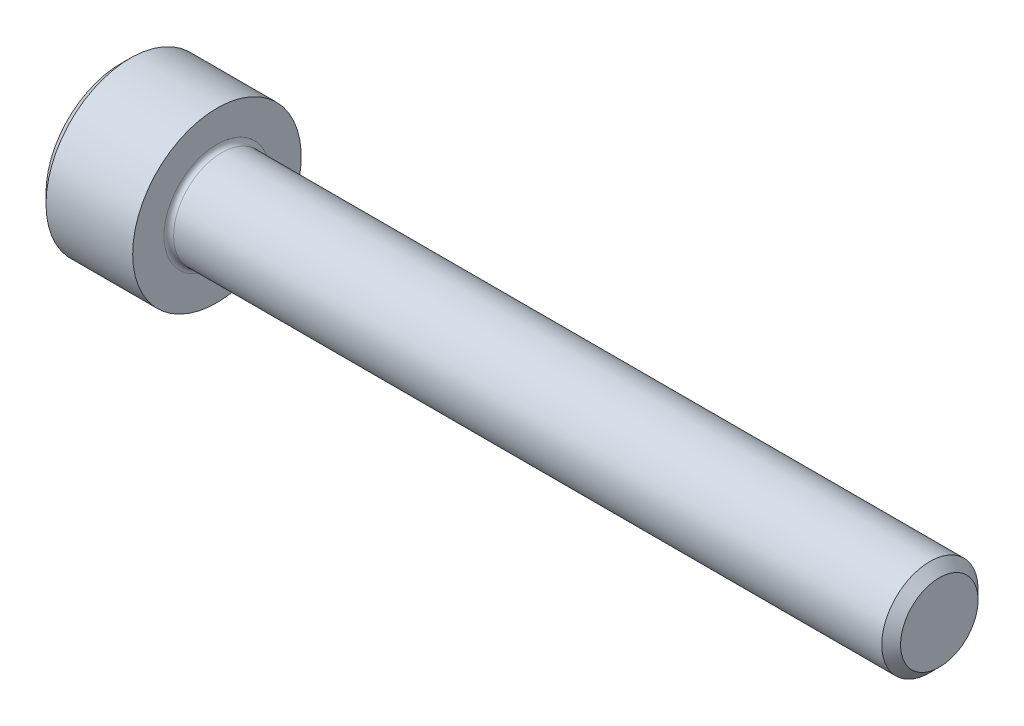
ISO-10303-21;
HEADER;
FILE_DESCRIPTION(('STEP AP214'),'2;1');
FILE_NAME('part.step','',(''),(''),'','','');
FILE_SCHEMA(('AUTOMOTIVE_DESIGN { 1 0 10303 214 1 1 1 1 }'));
ENDSEC;
DATA;
#1=APPLICATION_CONTEXT('core data for automotive mechanical design processes');
#2=APPLICATION_PROTOCOL_DEFINITION('international standard','automotive_design',2000,#1);
#3=PRODUCT_CONTEXT('',#1,'mechanical');
#4=PRODUCT('Part','Part','',(#3));
#5=PRODUCT_RELATED_PRODUCT_CATEGORY('part','',(#4));
#6=PRODUCT_DEFINITION_FORMATION('','',#4);
#7=PRODUCT_DEFINITION_CONTEXT('part definition',#1,'design');
#8=PRODUCT_DEFINITION('design','',#6,#7);
#9=PRODUCT_DEFINITION_SHAPE('','',#8);
#10=(LENGTH_UNIT() NAMED_UNIT(*) SI_UNIT(.MILLI.,.METRE.));
#11=(NAMED_UNIT(*) PLANE_ANGLE_UNIT() SI_UNIT($,.RADIAN.));
#12=(NAMED_UNIT(*) SI_UNIT($,.STERADIAN.) SOLID_ANGLE_UNIT());
#13=UNCERTAINTY_MEASURE_WITH_UNIT(LENGTH_MEASURE(1.E-05),#10,'distance_accuracy_value','');
#14=(GEOMETRIC_REPRESENTATION_CONTEXT(3) GLOBAL_UNCERTAINTY_ASSIGNED_CONTEXT((#13)) GLOBAL_UNIT_ASSIGNED_CONTEXT((#10,
#11,#12)) REPRESENTATION_CONTEXT('',''));
#15=CARTESIAN_POINT('',(0.,0.,0.));
#16=DIRECTION('',(0.,0.,1.));
#17=DIRECTION('',(1.,0.,0.));
#18=AXIS2_PLACEMENT_3D('',#15,#16,#17);
#19=CARTESIAN_POINT('',(0.,0.,0.));
#20=DIRECTION('',(-1.,0.,0.));
#21=DIRECTION('',(0.,0.,1.));
#22=AXIS2_PLACEMENT_3D('',#19,#20,#21);
#23=PLANE('',#22);
#24=DIRECTION('',(0.,-0.5,0.866025403784438));
#25=VECTOR('',#24,1.);
#26=CARTESIAN_POINT('',(0.,1.77304267668134,0.));
#27=LINE('',#26,#25);
#28=CARTESIAN_POINT('',(0.,1.77304267668134,0.));
#29=VERTEX_POINT('',#28);
#30=CARTESIAN_POINT('',(0.,0.886521338340669,1.5355));
#31=VERTEX_POINT('',#30);
#32=EDGE_CURVE('E387',#29,#31,#27,.T.);
#33=ORIENTED_EDGE('',*,*,#32,.T.);
#34=DIRECTION('',(0.,1.,0.));
#35=VECTOR('',#34,1.);
#36=CARTESIAN_POINT('',(0.,-0.886521338340673,1.5355));
#37=LINE('',#36,#35);
#38=CARTESIAN_POINT('',(0.,-0.886521338340673,1.5355));
#39=VERTEX_POINT('',#38);
#40=EDGE_CURVE('E131',#39,#31,#37,.T.);
#41=ORIENTED_EDGE('',*,*,#40,.F.);
#42=DIRECTION('',(0.,-0.500000000000001,-0.866025403784438));
#43=VECTOR('',#42,1.);
#44=CARTESIAN_POINT('',(0.,-0.886521338340673,1.5355));
#45=LINE('',#44,#43);
#46=CARTESIAN_POINT('',(0.,-1.77304267668135,0.));
#47=VERTEX_POINT('',#46);
#48=EDGE_CURVE('E390',#39,#47,#45,.T.);
#49=ORIENTED_EDGE('',*,*,#48,.T.);
#50=DIRECTION('',(0.,0.5,-0.866025403784439));
#51=VECTOR('',#50,1.);
#52=CARTESIAN_POINT('',(0.,-1.77304267668135,0.));
#53=LINE('',#52,#51);
#54=CARTESIAN_POINT('',(0.,-0.886521338340675,-1.5355));
#55=VERTEX_POINT('',#54);
#56=EDGE_CURVE('E393',#47,#55,#53,.T.);
#57=ORIENTED_EDGE('',*,*,#56,.T.);
#58=DIRECTION('',(0.,-1.,0.));
#59=VECTOR('',#58,1.);
#60=CARTESIAN_POINT('',(0.,0.886521338340666,-1.5355));
#61=LINE('',#60,#59);
#62=CARTESIAN_POINT('',(0.,0.886521338340666,-1.5355));
#63=VERTEX_POINT('',#62);
#64=EDGE_CURVE('E396',#63,#55,#61,.T.);
#65=ORIENTED_EDGE('',*,*,#64,.F.);
#66=DIRECTION('',(0.,-0.500000000000001,-0.866025403784438));
#67=VECTOR('',#66,1.);
#68=CARTESIAN_POINT('',(0.,1.77304267668134,0.));
#69=LINE('',#68,#67);
#70=EDGE_CURVE('E126',#29,#63,#69,.T.);
#71=ORIENTED_EDGE('',*,*,#70,.F.);
#72=EDGE_LOOP('',(#33,#41,#49,#57,#65,#71));
#73=FACE_BOUND('',#72,.T.);
#74=CARTESIAN_POINT('',(0.,0.,0.));
#75=DIRECTION('',(-1.,0.,0.));
#76=DIRECTION('',(0.,0.,1.));
#77=AXIS2_PLACEMENT_3D('',#74,#75,#76);
#78=CIRCLE('',#77,3.1);
#79=CARTESIAN_POINT('',(0.,0.,3.1));
#80=VERTEX_POINT('',#79);
#81=EDGE_CURVE('E142',#80,#80,#78,.T.);
#82=ORIENTED_EDGE('',*,*,#81,.T.);
#83=EDGE_LOOP('',(#82));
#84=FACE_BOUND('',#83,.T.);
#85=ADVANCED_FACE('F35',(#73,#84),#23,.T.);
#86=CARTESIAN_POINT('',(34.,1.61,0.));
#87=DIRECTION('',(1.,0.,0.));
#88=DIRECTION('',(0.,0.,-1.));
#89=AXIS2_PLACEMENT_3D('',#86,#87,#88);
#90=PLANE('',#89);
#91=CARTESIAN_POINT('',(34.,0.,0.));
#92=DIRECTION('',(-1.,0.,0.));
#93=DIRECTION('',(0.,0.,1.));
#94=AXIS2_PLACEMENT_3D('',#91,#92,#93);
#95=CIRCLE('',#94,1.61);
#96=CARTESIAN_POINT('',(34.,0.,1.61));
#97=VERTEX_POINT('',#96);
#98=EDGE_CURVE('E155',#97,#97,#95,.T.);
#99=ORIENTED_EDGE('',*,*,#98,.F.);
#100=EDGE_LOOP('',(#99));
#101=FACE_BOUND('',#100,.T.);
#102=ADVANCED_FACE('F176',(#101),#90,.T.);
#103=CARTESIAN_POINT('',(34.,0.,0.));
#104=DIRECTION('',(-1.,0.,0.));
#105=DIRECTION('',(0.,0.,1.));
#106=AXIS2_PLACEMENT_3D('',#103,#104,#105);
#107=CONICAL_SURFACE('',#106,1.61,0.78539816339732);
#108=CARTESIAN_POINT('',(33.61,0.,0.));
#109=DIRECTION('',(-1.,0.,0.));
#110=DIRECTION('',(0.,0.,1.));
#111=AXIS2_PLACEMENT_3D('',#108,#109,#110);
#112=CIRCLE('',#111,1.99999999999994);
#113=CARTESIAN_POINT('',(33.61,0.,1.99999999999994));
#114=VERTEX_POINT('',#113);
#115=EDGE_CURVE('E152',#114,#114,#112,.T.);
#116=ORIENTED_EDGE('',*,*,#115,.F.);
#117=EDGE_LOOP('',(#116));
#118=FACE_BOUND('',#117,.T.);
#119=ORIENTED_EDGE('',*,*,#98,.T.);
#120=EDGE_LOOP('',(#119));
#121=FACE_BOUND('',#120,.T.);
#122=ADVANCED_FACE('F182',(#118,#121),#107,.T.);
#123=CARTESIAN_POINT('',(-31.75,0.,0.));
#124=DIRECTION('',(-1.,0.,0.));
#125=DIRECTION('',(0.,0.,1.));
#126=AXIS2_PLACEMENT_3D('',#123,#124,#125);
#127=CYLINDRICAL_SURFACE('',#126,1.99999999999997);
#128=CARTESIAN_POINT('',(4.2,0.,0.));
#129=DIRECTION('',(1.,0.,0.));
#130=DIRECTION('',(0.,0.,-1.));
#131=AXIS2_PLACEMENT_3D('',#128,#129,#130);
#132=CIRCLE('',#131,1.99999999999997);
#133=CARTESIAN_POINT('',(4.2,0.,-1.99999999999997));
#134=VERTEX_POINT('',#133);
#135=EDGE_CURVE('E11',#134,#134,#132,.T.);
#136=ORIENTED_EDGE('',*,*,#135,.T.);
#137=EDGE_LOOP('',(#136));
#138=FACE_BOUND('',#137,.T.);
#139=ORIENTED_EDGE('',*,*,#115,.T.);
#140=EDGE_LOOP('',(#139));
#141=FACE_BOUND('',#140,.T.);
#142=ADVANCED_FACE('F193',(#138,#141),#127,.T.);
#143=CARTESIAN_POINT('',(4.,3.5,0.));
#144=DIRECTION('',(1.,0.,0.));
#145=DIRECTION('',(0.,0.,-1.));
#146=AXIS2_PLACEMENT_3D('',#143,#144,#145);
#147=PLANE('',#146);
#148=CARTESIAN_POINT('',(4.,0.,0.));
#149=DIRECTION('',(1.,0.,0.));
#150=DIRECTION('',(0.,0.,-1.));
#151=AXIS2_PLACEMENT_3D('',#148,#149,#150);
#152=CIRCLE('',#151,2.19999999999997);
#153=CARTESIAN_POINT('',(4.,0.,-2.19999999999997));
#154=VERTEX_POINT('',#153);
#155=EDGE_CURVE('E43',#154,#154,#152,.F.);
#156=ORIENTED_EDGE('',*,*,#155,.T.);
#157=EDGE_LOOP('',(#156));
#158=FACE_BOUND('',#157,.T.);
#159=CARTESIAN_POINT('',(4.,0.,0.));
#160=DIRECTION('',(-1.,0.,0.));
#161=DIRECTION('',(0.,0.,1.));
#162=AXIS2_PLACEMENT_3D('',#159,#160,#161);
#163=CIRCLE('',#162,3.5);
#164=CARTESIAN_POINT('',(4.,0.,3.5));
#165=VERTEX_POINT('',#164);
#166=EDGE_CURVE('E149',#165,#165,#163,.T.);
#167=ORIENTED_EDGE('',*,*,#166,.F.);
#168=EDGE_LOOP('',(#167));
#169=FACE_BOUND('',#168,.T.);
#170=ADVANCED_FACE('F160',(#158,#169),#147,.T.);
#171=CARTESIAN_POINT('',(-31.75,0.,0.));
#172=DIRECTION('',(-1.,0.,0.));
#173=DIRECTION('',(0.,0.,1.));
#174=AXIS2_PLACEMENT_3D('',#171,#172,#173);
#175=CYLINDRICAL_SURFACE('',#174,3.5);
#176=ORIENTED_EDGE('',*,*,#166,.T.);
#177=EDGE_LOOP('',(#176));
#178=FACE_BOUND('',#177,.T.);
#179=CARTESIAN_POINT('',(0.399999999999998,0.,0.));
#180=DIRECTION('',(-1.,0.,0.));
#181=DIRECTION('',(0.,0.,1.));
#182=AXIS2_PLACEMENT_3D('',#179,#180,#181);
#183=CIRCLE('',#182,3.5);
#184=CARTESIAN_POINT('',(0.399999999999998,0.,3.5));
#185=VERTEX_POINT('',#184);
#186=EDGE_CURVE('E146',#185,#185,#183,.T.);
#187=ORIENTED_EDGE('',*,*,#186,.F.);
#188=EDGE_LOOP('',(#187));
#189=FACE_BOUND('',#188,.T.);
#190=ADVANCED_FACE('F171',(#178,#189),#175,.T.);
#191=CARTESIAN_POINT('',(0.,0.,0.));
#192=DIRECTION('',(1.,0.,0.));
#193=DIRECTION('',(0.,0.,-1.));
#194=AXIS2_PLACEMENT_3D('',#191,#192,#193);
#195=CONICAL_SURFACE('',#194,3.1,0.78539816339745);
#196=ORIENTED_EDGE('',*,*,#186,.T.);
#197=EDGE_LOOP('',(#196));
#198=FACE_BOUND('',#197,.T.);
#199=ORIENTED_EDGE('',*,*,#81,.F.);
#200=EDGE_LOOP('',(#199));
#201=FACE_BOUND('',#200,.T.);
#202=ADVANCED_FACE('F164',(#198,#201),#195,.T.);
#203=CARTESIAN_POINT('',(4.2,0.,0.));
#204=DIRECTION('',(1.,0.,0.));
#205=DIRECTION('',(0.,0.,-1.));
#206=AXIS2_PLACEMENT_3D('',#203,#204,#205);
#207=TOROIDAL_SURFACE('',#206,2.19999999999997,0.2);
#208=ORIENTED_EDGE('',*,*,#135,.F.);
#209=EDGE_LOOP('',(#208));
#210=FACE_BOUND('',#209,.T.);
#211=ORIENTED_EDGE('',*,*,#155,.F.);
#212=EDGE_LOOP('',(#211));
#213=FACE_BOUND('',#212,.T.);
#214=ADVANCED_FACE('F37',(#210,#213),#207,.F.);
#215=CARTESIAN_POINT('',(2.,1.77304267668134,0.));
#216=DIRECTION('',(0.,-0.866025403784439,-0.5));
#217=DIRECTION('',(0.,0.5,-0.866025403784438));
#218=AXIS2_PLACEMENT_3D('',#215,#216,#217);
#219=PLANE('',#218);
#220=ORIENTED_EDGE('',*,*,#32,.F.);
#221=DIRECTION('',(-1.,0.,0.));
#222=VECTOR('',#221,1.);
#223=CARTESIAN_POINT('',(2.,1.77304267668134,0.));
#224=LINE('',#223,#222);
#225=CARTESIAN_POINT('',(2.,1.77304267668134,0.));
#226=VERTEX_POINT('',#225);
#227=EDGE_CURVE('E377',#226,#29,#224,.T.);
#228=ORIENTED_EDGE('',*,*,#227,.F.);
#229=DIRECTION('',(0.,-0.5,0.866025403784438));
#230=VECTOR('',#229,1.);
#231=CARTESIAN_POINT('',(2.,1.77304267668134,0.));
#232=LINE('',#231,#230);
#233=CARTESIAN_POINT('',(2.,1.329782007511,0.767749999999999));
#234=VERTEX_POINT('',#233);
#235=EDGE_CURVE('E118',#226,#234,#232,.T.);
#236=ORIENTED_EDGE('',*,*,#235,.T.);
#237=CARTESIAN_POINT('',(2.,0.886521338340669,1.5355));
#238=VERTEX_POINT('',#237);
#239=EDGE_CURVE('E109',#234,#238,#232,.T.);
#240=ORIENTED_EDGE('',*,*,#239,.T.);
#241=DIRECTION('',(-1.,0.,0.));
#242=VECTOR('',#241,1.);
#243=CARTESIAN_POINT('',(2.,0.886521338340669,1.5355));
#244=LINE('',#243,#242);
#245=EDGE_CURVE('E123',#238,#31,#244,.T.);
#246=ORIENTED_EDGE('',*,*,#245,.T.);
#247=EDGE_LOOP('',(#220,#228,#236,#240,#246));
#248=FACE_BOUND('',#247,.T.);
#249=ADVANCED_FACE('F122',(#248),#219,.T.);
#250=CARTESIAN_POINT('',(2.,-0.886521338340673,1.5355));
#251=DIRECTION('',(0.,0.,1.));
#252=DIRECTION('',(0.,-1.,0.));
#253=AXIS2_PLACEMENT_3D('',#250,#251,#252);
#254=PLANE('',#253);
#255=ORIENTED_EDGE('',*,*,#40,.T.);
#256=ORIENTED_EDGE('',*,*,#245,.F.);
#257=DIRECTION('',(0.,1.,0.));
#258=VECTOR('',#257,1.);
#259=CARTESIAN_POINT('',(2.,-0.886521338340673,1.5355));
#260=LINE('',#259,#258);
#261=CARTESIAN_POINT('',(2.,0.,1.5355));
#262=VERTEX_POINT('',#261);
#263=EDGE_CURVE('E106',#262,#238,#260,.T.);
#264=ORIENTED_EDGE('',*,*,#263,.F.);
#265=CARTESIAN_POINT('',(2.,-0.886521338340673,1.5355));
#266=VERTEX_POINT('',#265);
#267=EDGE_CURVE('E117',#266,#262,#260,.T.);
#268=ORIENTED_EDGE('',*,*,#267,.F.);
#269=DIRECTION('',(-1.,0.,0.));
#270=VECTOR('',#269,1.);
#271=CARTESIAN_POINT('',(2.,-0.886521338340673,1.5355));
#272=LINE('',#271,#270);
#273=EDGE_CURVE('E133',#266,#39,#272,.T.);
#274=ORIENTED_EDGE('',*,*,#273,.T.);
#275=EDGE_LOOP('',(#255,#256,#264,#268,#274));
#276=FACE_BOUND('',#275,.T.);
#277=ADVANCED_FACE('F128',(#276),#254,.F.);
#278=CARTESIAN_POINT('',(2.,-0.886521338340673,1.5355));
#279=DIRECTION('',(0.,0.866025403784438,-0.500000000000001));
#280=DIRECTION('',(0.,0.500000000000001,0.866025403784438));
#281=AXIS2_PLACEMENT_3D('',#278,#279,#280);
#282=PLANE('',#281);
#283=ORIENTED_EDGE('',*,*,#48,.F.);
#284=ORIENTED_EDGE('',*,*,#273,.F.);
#285=DIRECTION('',(0.,-0.500000000000001,-0.866025403784438));
#286=VECTOR('',#285,1.);
#287=CARTESIAN_POINT('',(2.,-0.886521338340673,1.5355));
#288=LINE('',#287,#286);
#289=CARTESIAN_POINT('',(2.,-1.32978200751101,0.767750000000003));
#290=VERTEX_POINT('',#289);
#291=EDGE_CURVE('E416',#266,#290,#288,.T.);
#292=ORIENTED_EDGE('',*,*,#291,.T.);
#293=CARTESIAN_POINT('',(2.,-1.77304267668135,0.));
#294=VERTEX_POINT('',#293);
#295=EDGE_CURVE('E405',#290,#294,#288,.T.);
#296=ORIENTED_EDGE('',*,*,#295,.T.);
#297=DIRECTION('',(-1.,0.,0.));
#298=VECTOR('',#297,1.);
#299=CARTESIAN_POINT('',(2.,-1.77304267668135,0.));
#300=LINE('',#299,#298);
#301=EDGE_CURVE('E138',#294,#47,#300,.T.);
#302=ORIENTED_EDGE('',*,*,#301,.T.);
#303=EDGE_LOOP('',(#283,#284,#292,#296,#302));
#304=FACE_BOUND('',#303,.T.);
#305=ADVANCED_FACE('F268',(#304),#282,.T.);
#306=CARTESIAN_POINT('',(2.,-1.77304267668135,0.));
#307=DIRECTION('',(0.,0.866025403784439,0.5));
#308=DIRECTION('',(0.,-0.5,0.866025403784439));
#309=AXIS2_PLACEMENT_3D('',#306,#307,#308);
#310=PLANE('',#309);
#311=ORIENTED_EDGE('',*,*,#56,.F.);
#312=ORIENTED_EDGE('',*,*,#301,.F.);
#313=DIRECTION('',(0.,0.5,-0.866025403784439));
#314=VECTOR('',#313,1.);
#315=CARTESIAN_POINT('',(2.,-1.77304267668135,0.));
#316=LINE('',#315,#314);
#317=CARTESIAN_POINT('',(2.,-1.32978200751101,-0.767750000000002));
#318=VERTEX_POINT('',#317);
#319=EDGE_CURVE('E383',#294,#318,#316,.T.);
#320=ORIENTED_EDGE('',*,*,#319,.T.);
#321=CARTESIAN_POINT('',(2.,-0.886521338340675,-1.5355));
#322=VERTEX_POINT('',#321);
#323=EDGE_CURVE('E415',#318,#322,#316,.T.);
#324=ORIENTED_EDGE('',*,*,#323,.T.);
#325=DIRECTION('',(-1.,0.,0.));
#326=VECTOR('',#325,1.);
#327=CARTESIAN_POINT('',(2.,-0.886521338340675,-1.5355));
#328=LINE('',#327,#326);
#329=EDGE_CURVE('E376',#322,#55,#328,.T.);
#330=ORIENTED_EDGE('',*,*,#329,.T.);
#331=EDGE_LOOP('',(#311,#312,#320,#324,#330));
#332=FACE_BOUND('',#331,.T.);
#333=ADVANCED_FACE('F276',(#332),#310,.T.);
#334=CARTESIAN_POINT('',(2.,0.886521338340666,-1.5355));
#335=DIRECTION('',(0.,0.,-1.));
#336=DIRECTION('',(0.,1.,0.));
#337=AXIS2_PLACEMENT_3D('',#334,#335,#336);
#338=PLANE('',#337);
#339=ORIENTED_EDGE('',*,*,#64,.T.);
#340=ORIENTED_EDGE('',*,*,#329,.F.);
#341=DIRECTION('',(0.,-1.,0.));
#342=VECTOR('',#341,1.);
#343=CARTESIAN_POINT('',(2.,0.886521338340666,-1.5355));
#344=LINE('',#343,#342);
#345=CARTESIAN_POINT('',(2.,0.,-1.5355));
#346=VERTEX_POINT('',#345);
#347=EDGE_CURVE('E380',#346,#322,#344,.T.);
#348=ORIENTED_EDGE('',*,*,#347,.F.);
#349=CARTESIAN_POINT('',(2.,0.886521338340666,-1.5355));
#350=VERTEX_POINT('',#349);
#351=EDGE_CURVE('E50',#350,#346,#344,.T.);
#352=ORIENTED_EDGE('',*,*,#351,.F.);
#353=DIRECTION('',(-1.,0.,0.));
#354=VECTOR('',#353,1.);
#355=CARTESIAN_POINT('',(2.,0.886521338340666,-1.5355));
#356=LINE('',#355,#354);
#357=EDGE_CURVE('E373',#350,#63,#356,.T.);
#358=ORIENTED_EDGE('',*,*,#357,.T.);
#359=EDGE_LOOP('',(#339,#340,#348,#352,#358));
#360=FACE_BOUND('',#359,.T.);
#361=ADVANCED_FACE('F285',(#360),#338,.F.);
#362=CARTESIAN_POINT('',(2.,1.77304267668134,0.));
#363=DIRECTION('',(0.,0.866025403784438,-0.500000000000001));
#364=DIRECTION('',(0.,0.500000000000001,0.866025403784438));
#365=AXIS2_PLACEMENT_3D('',#362,#363,#364);
#366=PLANE('',#365);
#367=ORIENTED_EDGE('',*,*,#70,.T.);
#368=ORIENTED_EDGE('',*,*,#357,.F.);
#369=DIRECTION('',(0.,-0.500000000000001,-0.866025403784438));
#370=VECTOR('',#369,1.);
#371=CARTESIAN_POINT('',(2.,1.77304267668134,0.));
#372=LINE('',#371,#370);
#373=CARTESIAN_POINT('',(2.,1.329782007511,-0.767750000000002));
#374=VERTEX_POINT('',#373);
#375=EDGE_CURVE('E363',#374,#350,#372,.T.);
#376=ORIENTED_EDGE('',*,*,#375,.F.);
#377=EDGE_CURVE('E369',#226,#374,#372,.T.);
#378=ORIENTED_EDGE('',*,*,#377,.F.);
#379=ORIENTED_EDGE('',*,*,#227,.T.);
#380=EDGE_LOOP('',(#367,#368,#376,#378,#379));
#381=FACE_BOUND('',#380,.T.);
#382=ADVANCED_FACE('F294',(#381),#366,.F.);
#383=CARTESIAN_POINT('',(2.,1.77304267668134,0.));
#384=DIRECTION('',(1.,0.,0.));
#385=DIRECTION('',(0.,0.,-1.));
#386=AXIS2_PLACEMENT_3D('',#383,#384,#385);
#387=PLANE('',#386);
#388=ORIENTED_EDGE('',*,*,#347,.T.);
#389=ORIENTED_EDGE('',*,*,#323,.F.);
#390=CARTESIAN_POINT('',(2.,0.,0.));
#391=DIRECTION('',(-1.,0.,0.));
#392=DIRECTION('',(0.,0.,1.));
#393=AXIS2_PLACEMENT_3D('',#390,#391,#392);
#394=CIRCLE('',#393,1.5355);
#395=EDGE_CURVE('E411',#346,#318,#394,.T.);
#396=ORIENTED_EDGE('',*,*,#395,.F.);
#397=EDGE_LOOP('',(#388,#389,#396));
#398=FACE_BOUND('',#397,.T.);
#399=ADVANCED_FACE('F303',(#398),#387,.F.);
#400=ORIENTED_EDGE('',*,*,#319,.F.);
#401=ORIENTED_EDGE('',*,*,#295,.F.);
#402=EDGE_CURVE('E136',#318,#290,#394,.T.);
#403=ORIENTED_EDGE('',*,*,#402,.F.);
#404=EDGE_LOOP('',(#400,#401,#403));
#405=FACE_BOUND('',#404,.T.);
#406=ADVANCED_FACE('F312',(#405),#387,.F.);
#407=ORIENTED_EDGE('',*,*,#291,.F.);
#408=ORIENTED_EDGE('',*,*,#267,.T.);
#409=EDGE_CURVE('E132',#290,#262,#394,.T.);
#410=ORIENTED_EDGE('',*,*,#409,.F.);
#411=EDGE_LOOP('',(#407,#408,#410));
#412=FACE_BOUND('',#411,.T.);
#413=ADVANCED_FACE('F321',(#412),#387,.F.);
#414=ORIENTED_EDGE('',*,*,#263,.T.);
#415=ORIENTED_EDGE('',*,*,#239,.F.);
#416=EDGE_CURVE('E112',#262,#234,#394,.T.);
#417=ORIENTED_EDGE('',*,*,#416,.F.);
#418=EDGE_LOOP('',(#414,#415,#417));
#419=FACE_BOUND('',#418,.T.);
#420=ADVANCED_FACE('F108',(#419),#387,.F.);
#421=ORIENTED_EDGE('',*,*,#235,.F.);
#422=ORIENTED_EDGE('',*,*,#377,.T.);
#423=EDGE_CURVE('E143',#234,#374,#394,.T.);
#424=ORIENTED_EDGE('',*,*,#423,.F.);
#425=EDGE_LOOP('',(#421,#422,#424));
#426=FACE_BOUND('',#425,.T.);
#427=ADVANCED_FACE('F336',(#426),#387,.F.);
#428=ORIENTED_EDGE('',*,*,#375,.T.);
#429=ORIENTED_EDGE('',*,*,#351,.T.);
#430=EDGE_CURVE('E366',#374,#346,#394,.T.);
#431=ORIENTED_EDGE('',*,*,#430,.F.);
#432=EDGE_LOOP('',(#428,#429,#431));
#433=FACE_BOUND('',#432,.T.);
#434=ADVANCED_FACE('F251',(#433),#387,.F.);
#435=CARTESIAN_POINT('',(2.,0.,0.));
#436=DIRECTION('',(-1.,0.,0.));
#437=DIRECTION('',(0.,0.,1.));
#438=AXIS2_PLACEMENT_3D('',#435,#436,#437);
#439=CONICAL_SURFACE('',#438,1.5355,1.04719755119659);
#440=CARTESIAN_POINT('',(2.88652133834068,0.,0.));
#441=VERTEX_POINT('',#440);
#442=VERTEX_LOOP('',#441);
#443=FACE_BOUND('',#442,.T.);
#444=ORIENTED_EDGE('',*,*,#416,.T.);
#445=ORIENTED_EDGE('',*,*,#423,.T.);
#446=ORIENTED_EDGE('',*,*,#430,.T.);
#447=ORIENTED_EDGE('',*,*,#395,.T.);
#448=ORIENTED_EDGE('',*,*,#402,.T.);
#449=ORIENTED_EDGE('',*,*,#409,.T.);
#450=EDGE_LOOP('',(#444,#445,#446,#447,#448,#449));
#451=FACE_BOUND('',#450,.T.);
#452=ADVANCED_FACE('F186',(#443,#451),#439,.F.);
#453=CLOSED_SHELL('',(#85,#102,#122,#142,#170,#190,#202,#214,#249,#277,#305,#333,#361,#382,#399,
#406,#413,#420,#427,#434,#452));
#454=MANIFOLD_SOLID_BREP('B2',#453);
#455=ADVANCED_BREP_SHAPE_REPRESENTATION('',(#18,#454),#14);
#456=SHAPE_DEFINITION_REPRESENTATION(#9,#455);
ENDSEC;
END-ISO-10303-21;
